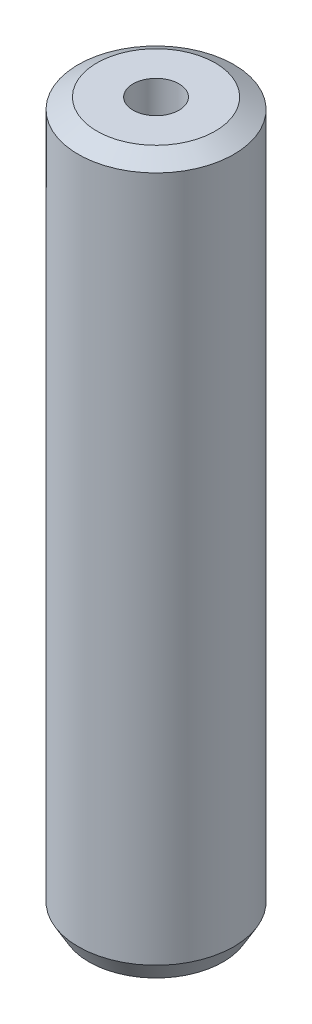
ISO-10303-21;
HEADER;
FILE_DESCRIPTION(('STEP AP214'),'2;1');
FILE_NAME('part.step','',(''),(''),'','','');
FILE_SCHEMA(('AUTOMOTIVE_DESIGN { 1 0 10303 214 1 1 1 1 }'));
ENDSEC;
DATA;
#1=APPLICATION_CONTEXT('core data for automotive mechanical design processes');
#2=APPLICATION_PROTOCOL_DEFINITION('international standard','automotive_design',2000,#1);
#3=PRODUCT_CONTEXT('',#1,'mechanical');
#4=PRODUCT('Part','Part','',(#3));
#5=PRODUCT_RELATED_PRODUCT_CATEGORY('part','',(#4));
#6=PRODUCT_DEFINITION_FORMATION('','',#4);
#7=PRODUCT_DEFINITION_CONTEXT('part definition',#1,'design');
#8=PRODUCT_DEFINITION('design','',#6,#7);
#9=PRODUCT_DEFINITION_SHAPE('','',#8);
#10=(LENGTH_UNIT() NAMED_UNIT(*) SI_UNIT(.MILLI.,.METRE.));
#11=(NAMED_UNIT(*) PLANE_ANGLE_UNIT() SI_UNIT($,.RADIAN.));
#12=(NAMED_UNIT(*) SI_UNIT($,.STERADIAN.) SOLID_ANGLE_UNIT());
#13=UNCERTAINTY_MEASURE_WITH_UNIT(LENGTH_MEASURE(1.E-05),#10,'distance_accuracy_value','');
#14=(GEOMETRIC_REPRESENTATION_CONTEXT(3) GLOBAL_UNCERTAINTY_ASSIGNED_CONTEXT((#13)) GLOBAL_UNIT_ASSIGNED_CONTEXT((#10,
#11,#12)) REPRESENTATION_CONTEXT('',''));
#15=CARTESIAN_POINT('',(0.,0.,0.));
#16=DIRECTION('',(0.,0.,1.));
#17=DIRECTION('',(1.,0.,0.));
#18=AXIS2_PLACEMENT_3D('',#15,#16,#17);
#19=CARTESIAN_POINT('',(0.,321.870180489488,0.));
#20=DIRECTION('',(0.,-1.,0.));
#21=DIRECTION('',(0.,0.,-1.));
#22=AXIS2_PLACEMENT_3D('',#19,#20,#21);
#23=CYLINDRICAL_SURFACE('',#22,35.);
#24=CARTESIAN_POINT('',(0.,317.022511994487,0.));
#25=DIRECTION('',(0.,1.,0.));
#26=DIRECTION('',(0.,0.,1.));
#27=AXIS2_PLACEMENT_3D('',#24,#25,#26);
#28=CIRCLE('',#27,35.);
#29=CARTESIAN_POINT('',(0.,317.022511994487,-35.0000000000001));
#30=VERTEX_POINT('',#29);
#31=EDGE_CURVE('E50',#30,#30,#28,.F.);
#32=ORIENTED_EDGE('',*,*,#31,.T.);
#33=EDGE_LOOP('',(#32));
#34=FACE_BOUND('',#33,.T.);
#35=CARTESIAN_POINT('',(0.,8.39640813159215,0.));
#36=DIRECTION('',(0.,1.,0.));
#37=DIRECTION('',(0.,0.,1.));
#38=AXIS2_PLACEMENT_3D('',#35,#36,#37);
#39=CIRCLE('',#38,35.);
#40=CARTESIAN_POINT('',(0.,8.39640813159215,35.));
#41=VERTEX_POINT('',#40);
#42=EDGE_CURVE('E51',#41,#41,#39,.T.);
#43=ORIENTED_EDGE('',*,*,#42,.T.);
#44=EDGE_LOOP('',(#43));
#45=FACE_BOUND('',#44,.T.);
#46=ADVANCED_FACE('F39',(#34,#45),#23,.T.);
#47=CARTESIAN_POINT('',(0.,321.870180489488,0.));
#48=DIRECTION('',(0.,1.,0.));
#49=DIRECTION('',(0.,0.,1.));
#50=AXIS2_PLACEMENT_3D('',#47,#48,#49);
#51=PLANE('',#50);
#52=CARTESIAN_POINT('',(0.,321.870180489488,0.));
#53=DIRECTION('',(0.,1.,0.));
#54=DIRECTION('',(0.,0.,1.));
#55=AXIS2_PLACEMENT_3D('',#52,#53,#54);
#56=CIRCLE('',#55,26.603591868408);
#57=CARTESIAN_POINT('',(0.,321.870180489488,-26.6035918684081));
#58=VERTEX_POINT('',#57);
#59=EDGE_CURVE('E54',#58,#58,#56,.T.);
#60=ORIENTED_EDGE('',*,*,#59,.T.);
#61=EDGE_LOOP('',(#60));
#62=FACE_BOUND('',#61,.T.);
#63=CARTESIAN_POINT('',(0.,321.870180489488,0.));
#64=DIRECTION('',(0.,1.,0.));
#65=DIRECTION('',(0.,0.,1.));
#66=AXIS2_PLACEMENT_3D('',#63,#64,#65);
#67=CIRCLE('',#66,10.31295986869);
#68=CARTESIAN_POINT('',(0.,321.870180489488,10.31295986869));
#69=VERTEX_POINT('',#68);
#70=EDGE_CURVE('E58',#69,#69,#67,.T.);
#71=ORIENTED_EDGE('',*,*,#70,.F.);
#72=EDGE_LOOP('',(#71));
#73=FACE_BOUND('',#72,.T.);
#74=ADVANCED_FACE('F69',(#62,#73),#51,.T.);
#75=CARTESIAN_POINT('',(0.,0.,0.));
#76=DIRECTION('',(0.,1.,0.));
#77=DIRECTION('',(0.,0.,1.));
#78=AXIS2_PLACEMENT_3D('',#75,#76,#77);
#79=PLANE('',#78);
#80=CARTESIAN_POINT('',(0.,0.,0.));
#81=DIRECTION('',(0.,1.,0.));
#82=DIRECTION('',(0.,0.,1.));
#83=AXIS2_PLACEMENT_3D('',#80,#81,#82);
#84=CIRCLE('',#83,30.1523315049993);
#85=CARTESIAN_POINT('',(0.,0.,30.1523315049993));
#86=VERTEX_POINT('',#85);
#87=EDGE_CURVE('E10',#86,#86,#84,.F.);
#88=ORIENTED_EDGE('',*,*,#87,.T.);
#89=EDGE_LOOP('',(#88));
#90=FACE_BOUND('',#89,.T.);
#91=CARTESIAN_POINT('',(0.,0.,0.));
#92=DIRECTION('',(0.,1.,0.));
#93=DIRECTION('',(0.,0.,1.));
#94=AXIS2_PLACEMENT_3D('',#91,#92,#93);
#95=CIRCLE('',#94,10.31295986869);
#96=CARTESIAN_POINT('',(0.,0.,10.31295986869));
#97=VERTEX_POINT('',#96);
#98=EDGE_CURVE('E63',#97,#97,#95,.T.);
#99=ORIENTED_EDGE('',*,*,#98,.T.);
#100=EDGE_LOOP('',(#99));
#101=FACE_BOUND('',#100,.T.);
#102=ADVANCED_FACE('F75',(#90,#101),#79,.F.);
#103=CARTESIAN_POINT('',(0.,321.870180489488,0.));
#104=DIRECTION('',(0.,-1.,0.));
#105=DIRECTION('',(0.,0.,-1.));
#106=AXIS2_PLACEMENT_3D('',#103,#104,#105);
#107=CYLINDRICAL_SURFACE('',#106,10.31295986869);
#108=ORIENTED_EDGE('',*,*,#70,.T.);
#109=EDGE_LOOP('',(#108));
#110=FACE_BOUND('',#109,.T.);
#111=ORIENTED_EDGE('',*,*,#98,.F.);
#112=EDGE_LOOP('',(#111));
#113=FACE_BOUND('',#112,.T.);
#114=ADVANCED_FACE('F70',(#110,#113),#107,.F.);
#115=CARTESIAN_POINT('',(0.,321.870180489488,0.));
#116=DIRECTION('',(0.,-1.,0.));
#117=DIRECTION('',(0.,0.,-1.));
#118=AXIS2_PLACEMENT_3D('',#115,#116,#117);
#119=CONICAL_SURFACE('',#118,26.603591868408,1.04719755119659);
#120=CARTESIAN_POINT('',(0.,317.022511994487,-35.0000000000001));
#121=CARTESIAN_POINT('',(0.,317.07300854131,-34.912537415296));
#122=CARTESIAN_POINT('',(0.,317.123505088133,-34.8250748305919));
#123=CARTESIAN_POINT('',(0.,317.224498181779,-34.6501496611837));
#124=CARTESIAN_POINT('',(0.,317.274994728602,-34.5626870764796));
#125=CARTESIAN_POINT('',(0.,317.375987822248,-34.3877619070715));
#126=CARTESIAN_POINT('',(0.,317.426484369071,-34.3002993223674));
#127=CARTESIAN_POINT('',(0.,317.527477462716,-34.1253741529592));
#128=CARTESIAN_POINT('',(0.,317.577974009539,-34.0379115682552));
#129=CARTESIAN_POINT('',(0.,317.678967103185,-33.862986398847));
#130=CARTESIAN_POINT('',(0.,317.729463650008,-33.7755238141429));
#131=CARTESIAN_POINT('',(0.,317.830456743654,-33.6005986447347));
#132=CARTESIAN_POINT('',(0.,317.880953290477,-33.5131360600307));
#133=CARTESIAN_POINT('',(0.,317.981946384123,-33.3382108906225));
#134=CARTESIAN_POINT('',(0.,318.032442930946,-33.2507483059184));
#135=CARTESIAN_POINT('',(0.,318.133436024591,-33.0758231365102));
#136=CARTESIAN_POINT('',(0.,318.183932571414,-32.9883605518062));
#137=CARTESIAN_POINT('',(0.,318.28492566506,-32.813435382398));
#138=CARTESIAN_POINT('',(0.,318.335422211883,-32.7259727976939));
#139=CARTESIAN_POINT('',(0.,318.436415305529,-32.5510476282857));
#140=CARTESIAN_POINT('',(0.,318.486911852352,-32.4635850435817));
#141=CARTESIAN_POINT('',(0.,318.587904945998,-32.2886598741735));
#142=CARTESIAN_POINT('',(0.,318.638401492821,-32.2011972894694));
#143=CARTESIAN_POINT('',(0.,318.739394586467,-32.0262721200612));
#144=CARTESIAN_POINT('',(0.,318.789891133289,-31.9388095353572));
#145=CARTESIAN_POINT('',(0.,318.890884226935,-31.763884365949));
#146=CARTESIAN_POINT('',(0.,318.941380773758,-31.6764217812449));
#147=CARTESIAN_POINT('',(0.,319.042373867404,-31.5014966118367));
#148=CARTESIAN_POINT('',(0.,319.092870414227,-31.4140340271327));
#149=CARTESIAN_POINT('',(0.,319.193863507873,-31.2391088577245));
#150=CARTESIAN_POINT('',(0.,319.244360054696,-31.1516462730204));
#151=CARTESIAN_POINT('',(0.,319.345353148342,-30.9767211036122));
#152=CARTESIAN_POINT('',(0.,319.395849695164,-30.8892585189082));
#153=CARTESIAN_POINT('',(0.,319.49684278881,-30.7143333495));
#154=CARTESIAN_POINT('',(0.,319.547339335633,-30.6268707647959));
#155=CARTESIAN_POINT('',(0.,319.648332429279,-30.4519455953878));
#156=CARTESIAN_POINT('',(0.,319.698828976102,-30.3644830106837));
#157=CARTESIAN_POINT('',(0.,319.799822069748,-30.1895578412755));
#158=CARTESIAN_POINT('',(0.,319.850318616571,-30.1020952565714));
#159=CARTESIAN_POINT('',(0.,319.951311710217,-29.9271700871632));
#160=CARTESIAN_POINT('',(0.,320.00180825704,-29.8397075024592));
#161=CARTESIAN_POINT('',(0.,320.102801350685,-29.664782333051));
#162=CARTESIAN_POINT('',(0.,320.153297897508,-29.5773197483469));
#163=CARTESIAN_POINT('',(0.,320.254290991154,-29.4023945789388));
#164=CARTESIAN_POINT('',(0.,320.304787537977,-29.3149319942347));
#165=CARTESIAN_POINT('',(0.,320.405780631623,-29.1400068248265));
#166=CARTESIAN_POINT('',(0.,320.456277178446,-29.0525442401224));
#167=CARTESIAN_POINT('',(0.,320.557270272092,-28.8776190707142));
#168=CARTESIAN_POINT('',(0.,320.607766818915,-28.7901564860102));
#169=CARTESIAN_POINT('',(0.,320.708759912561,-28.615231316602));
#170=CARTESIAN_POINT('',(0.,320.759256459383,-28.5277687318979));
#171=CARTESIAN_POINT('',(0.,320.860249553029,-28.3528435624898));
#172=CARTESIAN_POINT('',(0.,320.910746099852,-28.2653809777857));
#173=CARTESIAN_POINT('',(0.,321.011739193498,-28.0904558083775));
#174=CARTESIAN_POINT('',(0.,321.062235740321,-28.0029932236734));
#175=CARTESIAN_POINT('',(0.,321.163228833967,-27.8280680542653));
#176=CARTESIAN_POINT('',(0.,321.21372538079,-27.7406054695612));
#177=CARTESIAN_POINT('',(0.,321.314718474436,-27.565680300153));
#178=CARTESIAN_POINT('',(0.,321.365215021259,-27.4782177154489));
#179=CARTESIAN_POINT('',(0.,321.466208114904,-27.3032925460408));
#180=CARTESIAN_POINT('',(0.,321.516704661727,-27.2158299613367));
#181=CARTESIAN_POINT('',(0.,321.617697755373,-27.0409047919285));
#182=CARTESIAN_POINT('',(0.,321.668194302196,-26.9534422072244));
#183=CARTESIAN_POINT('',(0.,321.769187395842,-26.7785170378163));
#184=CARTESIAN_POINT('',(0.,321.819683942665,-26.6910544531122));
#185=CARTESIAN_POINT('',(0.,321.870180489488,-26.6035918684081));
#186=B_SPLINE_CURVE_WITH_KNOTS('',3,(#120,#121,#122,#123,#124,#125,#126,#127,#128,#129,#130,
#131,#132,#133,#134,#135,#136,#137,#138,#139,#140,#141,#142,#143,#144,#145,#146,#147,#148,#149,
#150,#151,#152,#153,#154,#155,#156,#157,#158,#159,#160,#161,#162,#163,#164,#165,#166,#167,#168,
#169,#170,#171,#172,#173,#174,#175,#176,#177,#178,#179,#180,#181,#182,#183,#184,#185),
.UNSPECIFIED.,.F.,.F.,(4,2,2,2,2,2,2,2,2,2,2,2,2,2,2,2,2,2,2,2,2,2,2,2,2,2,2,2,2,2,2,2,4),(0.,
0.302979280937548,0.605958561875096,0.908937842812617,1.21191712375016,1.51489640468769,
1.81787568562523,2.12085496656276,2.42383424750031,2.72681352843786,3.02979280937538,
3.33277209031293,3.63575137125045,3.938730652188,4.24170993312552,4.54468921406307,
4.84766849500059,5.15064777593814,5.45362705687569,5.75660633781321,6.05958561875076,
6.36256489968828,6.66554418062583,6.96852346156335,7.2715027425009,7.57448202343845,
7.87746130437597,8.18044058531352,8.48341986625104,8.78639914718859,9.08937842812611,
9.39235770906366,9.69533699000121),.UNSPECIFIED.);
#187=EDGE_CURVE('BSEAM81',#30,#58,#186,.T.);
#188=ORIENTED_EDGE('',*,*,#31,.F.);
#189=ORIENTED_EDGE('',*,*,#59,.F.);
#190=ORIENTED_EDGE('',*,*,#187,.T.);
#191=ORIENTED_EDGE('',*,*,#187,.F.);
#192=EDGE_LOOP('',(#188,#190,#189,#191));
#193=FACE_BOUND('',#192,.T.);
#194=ADVANCED_FACE('F81',(#193),#119,.T.);
#195=CARTESIAN_POINT('',(0.,8.39640813159215,0.));
#196=DIRECTION('',(0.,1.,0.));
#197=DIRECTION('',(0.,0.,1.));
#198=AXIS2_PLACEMENT_3D('',#195,#196,#197);
#199=CONICAL_SURFACE('',#198,35.,0.523598775598301);
#200=ORIENTED_EDGE('',*,*,#87,.F.);
#201=EDGE_LOOP('',(#200));
#202=FACE_BOUND('',#201,.T.);
#203=ORIENTED_EDGE('',*,*,#42,.F.);
#204=EDGE_LOOP('',(#203));
#205=FACE_BOUND('',#204,.T.);
#206=ADVANCED_FACE('F45',(#202,#205),#199,.T.);
#207=CLOSED_SHELL('',(#46,#74,#102,#114,#194,#206));
#208=MANIFOLD_SOLID_BREP('B2',#207);
#209=ADVANCED_BREP_SHAPE_REPRESENTATION('',(#18,#208),#14);
#210=SHAPE_DEFINITION_REPRESENTATION(#9,#209);
ENDSEC;
END-ISO-10303-21;
